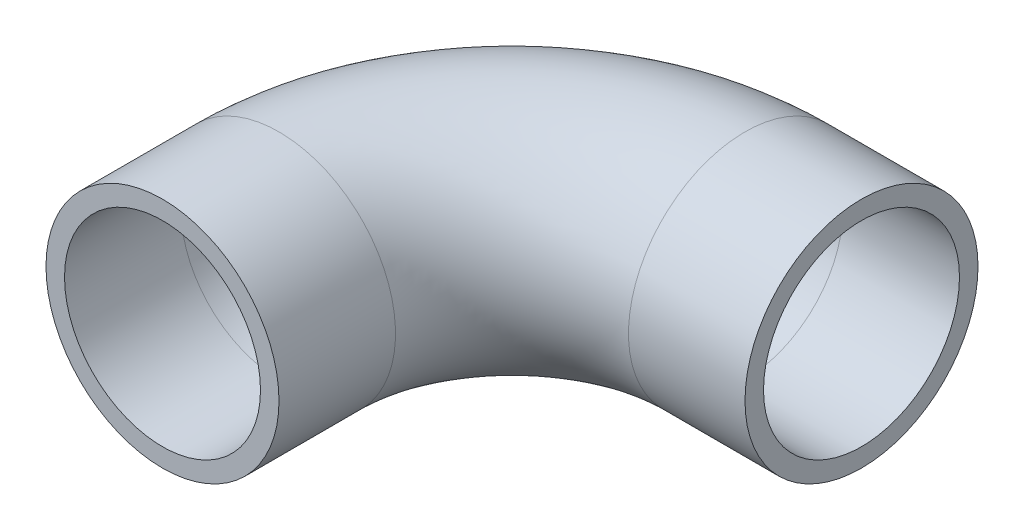
ISO-10303-21;
HEADER;
FILE_DESCRIPTION(('STEP AP214'),'2;1');
FILE_NAME('part.step','',(''),(''),'','','');
FILE_SCHEMA(('AUTOMOTIVE_DESIGN { 1 0 10303 214 1 1 1 1 }'));
ENDSEC;
DATA;
#1=APPLICATION_CONTEXT('core data for automotive mechanical design processes');
#2=APPLICATION_PROTOCOL_DEFINITION('international standard','automotive_design',2000,#1);
#3=PRODUCT_CONTEXT('',#1,'mechanical');
#4=PRODUCT('Part','Part','',(#3));
#5=PRODUCT_RELATED_PRODUCT_CATEGORY('part','',(#4));
#6=PRODUCT_DEFINITION_FORMATION('','',#4);
#7=PRODUCT_DEFINITION_CONTEXT('part definition',#1,'design');
#8=PRODUCT_DEFINITION('design','',#6,#7);
#9=PRODUCT_DEFINITION_SHAPE('','',#8);
#10=(LENGTH_UNIT() NAMED_UNIT(*) SI_UNIT(.MILLI.,.METRE.));
#11=(NAMED_UNIT(*) PLANE_ANGLE_UNIT() SI_UNIT($,.RADIAN.));
#12=(NAMED_UNIT(*) SI_UNIT($,.STERADIAN.) SOLID_ANGLE_UNIT());
#13=UNCERTAINTY_MEASURE_WITH_UNIT(LENGTH_MEASURE(1.E-05),#10,'distance_accuracy_value','');
#14=(GEOMETRIC_REPRESENTATION_CONTEXT(3) GLOBAL_UNCERTAINTY_ASSIGNED_CONTEXT((#13)) GLOBAL_UNIT_ASSIGNED_CONTEXT((#10,
#11,#12)) REPRESENTATION_CONTEXT('',''));
#15=CARTESIAN_POINT('',(0.,0.,0.));
#16=DIRECTION('',(0.,0.,1.));
#17=DIRECTION('',(1.,0.,0.));
#18=AXIS2_PLACEMENT_3D('',#15,#16,#17);
#19=CARTESIAN_POINT('',(0.,0.,0.));
#20=DIRECTION('',(0.,0.,-1.));
#21=DIRECTION('',(-1.,0.,0.));
#22=AXIS2_PLACEMENT_3D('',#19,#20,#21);
#23=CYLINDRICAL_SURFACE('',#22,12.7);
#24=CARTESIAN_POINT('',(0.,0.,-12.7));
#25=DIRECTION('',(0.,0.,1.));
#26=DIRECTION('',(1.,0.,0.));
#27=AXIS2_PLACEMENT_3D('',#24,#25,#26);
#28=CIRCLE('',#27,12.7);
#29=CARTESIAN_POINT('',(-12.7,0.,-12.7));
#30=VERTEX_POINT('',#29);
#31=EDGE_CURVE('E98',#30,#30,#28,.T.);
#32=ORIENTED_EDGE('',*,*,#31,.T.);
#33=EDGE_LOOP('',(#32));
#34=FACE_BOUND('',#33,.T.);
#35=CARTESIAN_POINT('',(0.,0.,0.));
#36=DIRECTION('',(0.,0.,1.));
#37=DIRECTION('',(1.,0.,0.));
#38=AXIS2_PLACEMENT_3D('',#35,#36,#37);
#39=CIRCLE('',#38,12.7);
#40=CARTESIAN_POINT('',(12.7,0.,0.));
#41=VERTEX_POINT('',#40);
#42=EDGE_CURVE('E47',#41,#41,#39,.T.);
#43=ORIENTED_EDGE('',*,*,#42,.F.);
#44=EDGE_LOOP('',(#43));
#45=FACE_BOUND('',#44,.T.);
#46=ADVANCED_FACE('F32',(#34,#45),#23,.T.);
#47=CARTESIAN_POINT('',(25.4,0.,-12.7));
#48=DIRECTION('',(0.,-1.,0.));
#49=DIRECTION('',(0.,0.,-1.));
#50=AXIS2_PLACEMENT_3D('',#47,#48,#49);
#51=TOROIDAL_SURFACE('',#50,25.4,12.7);
#52=CARTESIAN_POINT('',(25.4,0.,-38.1));
#53=DIRECTION('',(-1.,0.,0.));
#54=DIRECTION('',(0.,0.,1.));
#55=AXIS2_PLACEMENT_3D('',#52,#53,#54);
#56=CIRCLE('',#55,12.7);
#57=CARTESIAN_POINT('',(25.4,0.,-50.8));
#58=VERTEX_POINT('',#57);
#59=EDGE_CURVE('E36',#58,#58,#56,.T.);
#60=CARTESIAN_POINT('',(25.4,0.,-12.7));
#61=DIRECTION('',(0.,-1.,0.));
#62=DIRECTION('',(0.,0.,-1.));
#63=AXIS2_PLACEMENT_3D('',#60,#61,#62);
#64=CIRCLE('',#63,38.1);
#65=EDGE_CURVE('',#30,#58,#64,.T.);
#66=ORIENTED_EDGE('',*,*,#31,.F.);
#67=ORIENTED_EDGE('',*,*,#59,.T.);
#68=ORIENTED_EDGE('',*,*,#65,.T.);
#69=ORIENTED_EDGE('',*,*,#65,.F.);
#70=EDGE_LOOP('',(#66,#68,#67,#69));
#71=FACE_BOUND('',#70,.T.);
#72=ADVANCED_FACE('F105',(#71),#51,.T.);
#73=CARTESIAN_POINT('',(25.4,0.,-38.1));
#74=DIRECTION('',(1.,0.,0.));
#75=DIRECTION('',(0.,0.,-1.));
#76=AXIS2_PLACEMENT_3D('',#73,#74,#75);
#77=CYLINDRICAL_SURFACE('',#76,12.7);
#78=CARTESIAN_POINT('',(38.1,0.,-38.1));
#79=DIRECTION('',(-1.,0.,0.));
#80=DIRECTION('',(0.,0.,1.));
#81=AXIS2_PLACEMENT_3D('',#78,#79,#80);
#82=CIRCLE('',#81,12.7);
#83=CARTESIAN_POINT('',(38.1,0.,-25.4));
#84=VERTEX_POINT('',#83);
#85=EDGE_CURVE('E52',#84,#84,#82,.T.);
#86=ORIENTED_EDGE('',*,*,#85,.T.);
#87=EDGE_LOOP('',(#86));
#88=FACE_BOUND('',#87,.T.);
#89=ORIENTED_EDGE('',*,*,#59,.F.);
#90=EDGE_LOOP('',(#89));
#91=FACE_BOUND('',#90,.T.);
#92=ADVANCED_FACE('F34',(#88,#91),#77,.T.);
#93=CARTESIAN_POINT('',(0.,0.,0.));
#94=DIRECTION('',(0.,0.,1.));
#95=DIRECTION('',(1.,0.,0.));
#96=AXIS2_PLACEMENT_3D('',#93,#94,#95);
#97=PLANE('',#96);
#98=CARTESIAN_POINT('',(0.,0.,0.));
#99=DIRECTION('',(0.,0.,1.));
#100=DIRECTION('',(1.,0.,0.));
#101=AXIS2_PLACEMENT_3D('',#98,#99,#100);
#102=CIRCLE('',#101,10.6807);
#103=CARTESIAN_POINT('',(10.6807,0.,0.));
#104=VERTEX_POINT('',#103);
#105=EDGE_CURVE('E91',#104,#104,#102,.F.);
#106=ORIENTED_EDGE('',*,*,#105,.T.);
#107=EDGE_LOOP('',(#106));
#108=FACE_BOUND('',#107,.T.);
#109=ORIENTED_EDGE('',*,*,#42,.T.);
#110=EDGE_LOOP('',(#109));
#111=FACE_BOUND('',#110,.T.);
#112=ADVANCED_FACE('F65',(#108,#111),#97,.T.);
#113=CARTESIAN_POINT('',(38.1,0.,-38.1));
#114=DIRECTION('',(-1.,0.,0.));
#115=DIRECTION('',(0.,0.,1.));
#116=AXIS2_PLACEMENT_3D('',#113,#114,#115);
#117=PLANE('',#116);
#118=CARTESIAN_POINT('',(38.1,0.,-38.1));
#119=DIRECTION('',(-1.,0.,0.));
#120=DIRECTION('',(0.,0.,1.));
#121=AXIS2_PLACEMENT_3D('',#118,#119,#120);
#122=CIRCLE('',#121,10.6807);
#123=CARTESIAN_POINT('',(38.1,0.,-27.4193));
#124=VERTEX_POINT('',#123);
#125=EDGE_CURVE('E11',#124,#124,#122,.F.);
#126=ORIENTED_EDGE('',*,*,#125,.F.);
#127=EDGE_LOOP('',(#126));
#128=FACE_BOUND('',#127,.T.);
#129=ORIENTED_EDGE('',*,*,#85,.F.);
#130=EDGE_LOOP('',(#129));
#131=FACE_BOUND('',#130,.T.);
#132=ADVANCED_FACE('F62',(#128,#131),#117,.F.);
#133=CARTESIAN_POINT('',(0.,0.,0.));
#134=DIRECTION('',(0.,0.,-1.));
#135=DIRECTION('',(-1.,0.,0.));
#136=AXIS2_PLACEMENT_3D('',#133,#134,#135);
#137=CYLINDRICAL_SURFACE('',#136,10.6807);
#138=CARTESIAN_POINT('',(0.,0.,-12.7));
#139=DIRECTION('',(0.,0.,1.));
#140=DIRECTION('',(1.,0.,0.));
#141=AXIS2_PLACEMENT_3D('',#138,#139,#140);
#142=CIRCLE('',#141,10.6807);
#143=CARTESIAN_POINT('',(-10.6807,0.,-12.7));
#144=VERTEX_POINT('',#143);
#145=EDGE_CURVE('E90',#144,#144,#142,.F.);
#146=ORIENTED_EDGE('',*,*,#145,.T.);
#147=EDGE_LOOP('',(#146));
#148=FACE_BOUND('',#147,.T.);
#149=ORIENTED_EDGE('',*,*,#105,.F.);
#150=EDGE_LOOP('',(#149));
#151=FACE_BOUND('',#150,.T.);
#152=ADVANCED_FACE('F64',(#148,#151),#137,.F.);
#153=CARTESIAN_POINT('',(25.4,0.,-12.7));
#154=DIRECTION('',(0.,-1.,0.));
#155=DIRECTION('',(0.,0.,-1.));
#156=AXIS2_PLACEMENT_3D('',#153,#154,#155);
#157=TOROIDAL_SURFACE('',#156,25.4,10.6807);
#158=CARTESIAN_POINT('',(25.4,0.,-38.1));
#159=DIRECTION('',(-1.,0.,0.));
#160=DIRECTION('',(0.,0.,1.));
#161=AXIS2_PLACEMENT_3D('',#158,#159,#160);
#162=CIRCLE('',#161,10.6807);
#163=CARTESIAN_POINT('',(25.4,0.,-48.7807));
#164=VERTEX_POINT('',#163);
#165=EDGE_CURVE('E41',#164,#164,#162,.F.);
#166=CARTESIAN_POINT('',(25.4,0.,-12.7));
#167=DIRECTION('',(0.,-1.,0.));
#168=DIRECTION('',(0.,0.,-1.));
#169=AXIS2_PLACEMENT_3D('',#166,#167,#168);
#170=CIRCLE('',#169,36.0807);
#171=EDGE_CURVE('',#144,#164,#170,.T.);
#172=ORIENTED_EDGE('',*,*,#145,.F.);
#173=ORIENTED_EDGE('',*,*,#165,.T.);
#174=ORIENTED_EDGE('',*,*,#171,.T.);
#175=ORIENTED_EDGE('',*,*,#171,.F.);
#176=EDGE_LOOP('',(#172,#174,#173,#175));
#177=FACE_BOUND('',#176,.T.);
#178=ADVANCED_FACE('F71',(#177),#157,.F.);
#179=CARTESIAN_POINT('',(25.4,0.,-38.1));
#180=DIRECTION('',(1.,0.,0.));
#181=DIRECTION('',(0.,0.,-1.));
#182=AXIS2_PLACEMENT_3D('',#179,#180,#181);
#183=CYLINDRICAL_SURFACE('',#182,10.6807);
#184=ORIENTED_EDGE('',*,*,#125,.T.);
#185=EDGE_LOOP('',(#184));
#186=FACE_BOUND('',#185,.T.);
#187=ORIENTED_EDGE('',*,*,#165,.F.);
#188=EDGE_LOOP('',(#187));
#189=FACE_BOUND('',#188,.T.);
#190=ADVANCED_FACE('F59',(#186,#189),#183,.F.);
#191=CLOSED_SHELL('',(#46,#72,#92,#112,#132,#152,#178,#190));
#192=MANIFOLD_SOLID_BREP('B2',#191);
#193=ADVANCED_BREP_SHAPE_REPRESENTATION('',(#18,#192),#14);
#194=SHAPE_DEFINITION_REPRESENTATION(#9,#193);
ENDSEC;
END-ISO-10303-21;
